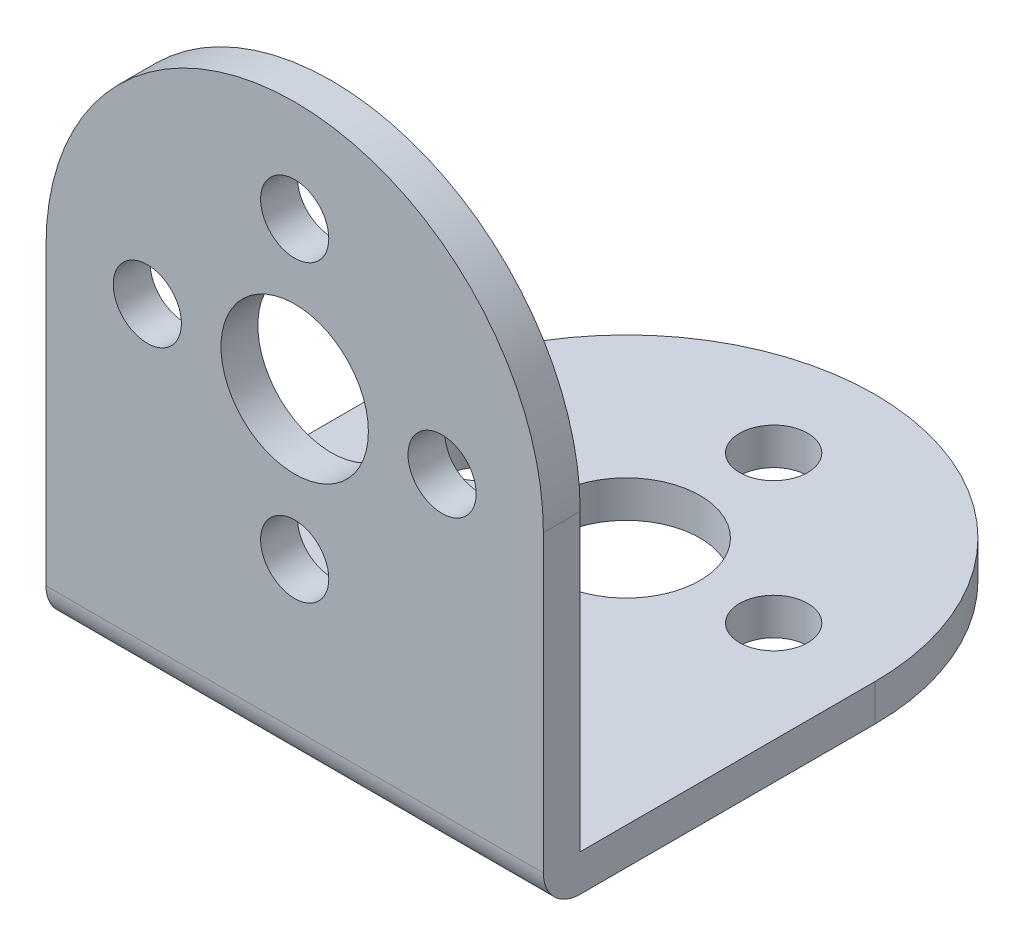
ISO-10303-21;
HEADER;
FILE_DESCRIPTION(('STEP AP214'),'2;1');
FILE_NAME('part.step','',(''),(''),'','','');
FILE_SCHEMA(('AUTOMOTIVE_DESIGN { 1 0 10303 214 1 1 1 1 }'));
ENDSEC;
DATA;
#1=APPLICATION_CONTEXT('core data for automotive mechanical design processes');
#2=APPLICATION_PROTOCOL_DEFINITION('international standard','automotive_design',2000,#1);
#3=PRODUCT_CONTEXT('',#1,'mechanical');
#4=PRODUCT('Part','Part','',(#3));
#5=PRODUCT_RELATED_PRODUCT_CATEGORY('part','',(#4));
#6=PRODUCT_DEFINITION_FORMATION('','',#4);
#7=PRODUCT_DEFINITION_CONTEXT('part definition',#1,'design');
#8=PRODUCT_DEFINITION('design','',#6,#7);
#9=PRODUCT_DEFINITION_SHAPE('','',#8);
#10=(LENGTH_UNIT() NAMED_UNIT(*) SI_UNIT(.MILLI.,.METRE.));
#11=(NAMED_UNIT(*) PLANE_ANGLE_UNIT() SI_UNIT($,.RADIAN.));
#12=(NAMED_UNIT(*) SI_UNIT($,.STERADIAN.) SOLID_ANGLE_UNIT());
#13=UNCERTAINTY_MEASURE_WITH_UNIT(LENGTH_MEASURE(1.E-05),#10,'distance_accuracy_value','');
#14=(GEOMETRIC_REPRESENTATION_CONTEXT(3) GLOBAL_UNCERTAINTY_ASSIGNED_CONTEXT((#13)) GLOBAL_UNIT_ASSIGNED_CONTEXT((#10,
#11,#12)) REPRESENTATION_CONTEXT('',''));
#15=CARTESIAN_POINT('',(0.,0.,0.));
#16=DIRECTION('',(0.,0.,1.));
#17=DIRECTION('',(1.,0.,0.));
#18=AXIS2_PLACEMENT_3D('',#15,#16,#17);
#19=CARTESIAN_POINT('',(0.,0.,-18.));
#20=DIRECTION('',(0.,1.,0.));
#21=DIRECTION('',(0.,0.,1.));
#22=AXIS2_PLACEMENT_3D('',#19,#20,#21);
#23=CYLINDRICAL_SURFACE('',#22,4.);
#24=CARTESIAN_POINT('',(0.,0.,-18.));
#25=DIRECTION('',(0.,1.,0.));
#26=DIRECTION('',(0.,0.,1.));
#27=AXIS2_PLACEMENT_3D('',#24,#25,#26);
#28=CIRCLE('',#27,4.);
#29=CARTESIAN_POINT('',(0.,0.,-14.));
#30=VERTEX_POINT('',#29);
#31=EDGE_CURVE('E18',#30,#30,#28,.T.);
#32=ORIENTED_EDGE('',*,*,#31,.F.);
#33=EDGE_LOOP('',(#32));
#34=FACE_BOUND('',#33,.T.);
#35=CARTESIAN_POINT('',(0.,2.,-18.));
#36=DIRECTION('',(0.,1.,0.));
#37=DIRECTION('',(0.,0.,1.));
#38=AXIS2_PLACEMENT_3D('',#35,#36,#37);
#39=CIRCLE('',#38,4.);
#40=CARTESIAN_POINT('',(0.,2.,-14.));
#41=VERTEX_POINT('',#40);
#42=EDGE_CURVE('E159',#41,#41,#39,.F.);
#43=ORIENTED_EDGE('',*,*,#42,.F.);
#44=EDGE_LOOP('',(#43));
#45=FACE_BOUND('',#44,.T.);
#46=ADVANCED_FACE('F15',(#34,#45),#23,.F.);
#47=CARTESIAN_POINT('',(0.,0.,-26.));
#48=DIRECTION('',(0.,1.,0.));
#49=DIRECTION('',(0.,0.,1.));
#50=AXIS2_PLACEMENT_3D('',#47,#48,#49);
#51=CYLINDRICAL_SURFACE('',#50,1.85);
#52=CARTESIAN_POINT('',(0.,0.,-26.));
#53=DIRECTION('',(0.,1.,0.));
#54=DIRECTION('',(0.,0.,1.));
#55=AXIS2_PLACEMENT_3D('',#52,#53,#54);
#56=CIRCLE('',#55,1.85);
#57=CARTESIAN_POINT('',(0.,0.,-24.15));
#58=VERTEX_POINT('',#57);
#59=EDGE_CURVE('E172',#58,#58,#56,.T.);
#60=ORIENTED_EDGE('',*,*,#59,.F.);
#61=EDGE_LOOP('',(#60));
#62=FACE_BOUND('',#61,.T.);
#63=CARTESIAN_POINT('',(0.,2.,-26.));
#64=DIRECTION('',(0.,1.,0.));
#65=DIRECTION('',(0.,0.,1.));
#66=AXIS2_PLACEMENT_3D('',#63,#64,#65);
#67=CIRCLE('',#66,1.85);
#68=CARTESIAN_POINT('',(0.,2.,-24.15));
#69=VERTEX_POINT('',#68);
#70=EDGE_CURVE('E156',#69,#69,#67,.F.);
#71=ORIENTED_EDGE('',*,*,#70,.F.);
#72=EDGE_LOOP('',(#71));
#73=FACE_BOUND('',#72,.T.);
#74=ADVANCED_FACE('F182',(#62,#73),#51,.F.);
#75=CARTESIAN_POINT('',(8.,0.,-18.));
#76=DIRECTION('',(0.,1.,0.));
#77=DIRECTION('',(0.,0.,1.));
#78=AXIS2_PLACEMENT_3D('',#75,#76,#77);
#79=CYLINDRICAL_SURFACE('',#78,1.85);
#80=CARTESIAN_POINT('',(8.,0.,-18.));
#81=DIRECTION('',(0.,1.,0.));
#82=DIRECTION('',(0.,0.,1.));
#83=AXIS2_PLACEMENT_3D('',#80,#81,#82);
#84=CIRCLE('',#83,1.85);
#85=CARTESIAN_POINT('',(8.,0.,-16.15));
#86=VERTEX_POINT('',#85);
#87=EDGE_CURVE('E170',#86,#86,#84,.T.);
#88=ORIENTED_EDGE('',*,*,#87,.F.);
#89=EDGE_LOOP('',(#88));
#90=FACE_BOUND('',#89,.T.);
#91=CARTESIAN_POINT('',(8.,2.,-18.));
#92=DIRECTION('',(0.,1.,0.));
#93=DIRECTION('',(0.,0.,1.));
#94=AXIS2_PLACEMENT_3D('',#91,#92,#93);
#95=CIRCLE('',#94,1.85);
#96=CARTESIAN_POINT('',(8.,2.,-16.15));
#97=VERTEX_POINT('',#96);
#98=EDGE_CURVE('E153',#97,#97,#95,.F.);
#99=ORIENTED_EDGE('',*,*,#98,.F.);
#100=EDGE_LOOP('',(#99));
#101=FACE_BOUND('',#100,.T.);
#102=ADVANCED_FACE('F364',(#90,#101),#79,.F.);
#103=CARTESIAN_POINT('',(0.,0.,-10.));
#104=DIRECTION('',(0.,1.,0.));
#105=DIRECTION('',(0.,0.,1.));
#106=AXIS2_PLACEMENT_3D('',#103,#104,#105);
#107=CYLINDRICAL_SURFACE('',#106,1.85);
#108=CARTESIAN_POINT('',(0.,0.,-10.));
#109=DIRECTION('',(0.,1.,0.));
#110=DIRECTION('',(0.,0.,1.));
#111=AXIS2_PLACEMENT_3D('',#108,#109,#110);
#112=CIRCLE('',#111,1.85);
#113=CARTESIAN_POINT('',(0.,0.,-8.15));
#114=VERTEX_POINT('',#113);
#115=EDGE_CURVE('E167',#114,#114,#112,.T.);
#116=ORIENTED_EDGE('',*,*,#115,.F.);
#117=EDGE_LOOP('',(#116));
#118=FACE_BOUND('',#117,.T.);
#119=CARTESIAN_POINT('',(0.,2.,-10.));
#120=DIRECTION('',(0.,1.,0.));
#121=DIRECTION('',(0.,0.,1.));
#122=AXIS2_PLACEMENT_3D('',#119,#120,#121);
#123=CIRCLE('',#122,1.85);
#124=CARTESIAN_POINT('',(0.,2.,-8.15));
#125=VERTEX_POINT('',#124);
#126=EDGE_CURVE('E150',#125,#125,#123,.F.);
#127=ORIENTED_EDGE('',*,*,#126,.F.);
#128=EDGE_LOOP('',(#127));
#129=FACE_BOUND('',#128,.T.);
#130=ADVANCED_FACE('F355',(#118,#129),#107,.F.);
#131=CARTESIAN_POINT('',(-8.,0.,-18.));
#132=DIRECTION('',(0.,1.,0.));
#133=DIRECTION('',(0.,0.,1.));
#134=AXIS2_PLACEMENT_3D('',#131,#132,#133);
#135=CYLINDRICAL_SURFACE('',#134,1.85);
#136=CARTESIAN_POINT('',(-8.,0.,-18.));
#137=DIRECTION('',(0.,1.,0.));
#138=DIRECTION('',(0.,0.,1.));
#139=AXIS2_PLACEMENT_3D('',#136,#137,#138);
#140=CIRCLE('',#139,1.85);
#141=CARTESIAN_POINT('',(-8.,0.,-16.15));
#142=VERTEX_POINT('',#141);
#143=EDGE_CURVE('E84',#142,#142,#140,.T.);
#144=ORIENTED_EDGE('',*,*,#143,.F.);
#145=EDGE_LOOP('',(#144));
#146=FACE_BOUND('',#145,.T.);
#147=CARTESIAN_POINT('',(-8.,2.,-18.));
#148=DIRECTION('',(0.,1.,0.));
#149=DIRECTION('',(0.,0.,1.));
#150=AXIS2_PLACEMENT_3D('',#147,#148,#149);
#151=CIRCLE('',#150,1.85);
#152=CARTESIAN_POINT('',(-8.,2.,-16.15));
#153=VERTEX_POINT('',#152);
#154=EDGE_CURVE('E147',#153,#153,#151,.F.);
#155=ORIENTED_EDGE('',*,*,#154,.F.);
#156=EDGE_LOOP('',(#155));
#157=FACE_BOUND('',#156,.T.);
#158=ADVANCED_FACE('F346',(#146,#157),#135,.F.);
#159=CARTESIAN_POINT('',(-13.5,0.,0.));
#160=DIRECTION('',(0.,-1.,0.));
#161=DIRECTION('',(0.,0.,-1.));
#162=AXIS2_PLACEMENT_3D('',#159,#160,#161);
#163=PLANE('',#162);
#164=ORIENTED_EDGE('',*,*,#143,.T.);
#165=EDGE_LOOP('',(#164));
#166=FACE_BOUND('',#165,.T.);
#167=ORIENTED_EDGE('',*,*,#115,.T.);
#168=EDGE_LOOP('',(#167));
#169=FACE_BOUND('',#168,.T.);
#170=ORIENTED_EDGE('',*,*,#87,.T.);
#171=EDGE_LOOP('',(#170));
#172=FACE_BOUND('',#171,.T.);
#173=ORIENTED_EDGE('',*,*,#59,.T.);
#174=EDGE_LOOP('',(#173));
#175=FACE_BOUND('',#174,.T.);
#176=ORIENTED_EDGE('',*,*,#31,.T.);
#177=EDGE_LOOP('',(#176));
#178=FACE_BOUND('',#177,.T.);
#179=CARTESIAN_POINT('',(0.,0.,-18.));
#180=DIRECTION('',(0.,1.,0.));
#181=DIRECTION('',(0.,0.,1.));
#182=AXIS2_PLACEMENT_3D('',#179,#180,#181);
#183=CIRCLE('',#182,13.5);
#184=CARTESIAN_POINT('',(13.5,0.,-18.));
#185=VERTEX_POINT('',#184);
#186=CARTESIAN_POINT('',(-13.5,0.,-18.));
#187=VERTEX_POINT('',#186);
#188=EDGE_CURVE('E73',#185,#187,#183,.T.);
#189=ORIENTED_EDGE('',*,*,#188,.F.);
#190=DIRECTION('',(0.,0.,-1.));
#191=VECTOR('',#190,1.);
#192=CARTESIAN_POINT('',(13.5,0.,0.));
#193=LINE('',#192,#191);
#194=CARTESIAN_POINT('',(13.5,0.,-2.));
#195=VERTEX_POINT('',#194);
#196=EDGE_CURVE('E77',#195,#185,#193,.T.);
#197=ORIENTED_EDGE('',*,*,#196,.F.);
#198=DIRECTION('',(-1.,0.,0.));
#199=VECTOR('',#198,1.);
#200=CARTESIAN_POINT('',(48.6972,0.,-2.));
#201=LINE('',#200,#199);
#202=CARTESIAN_POINT('',(-13.5,0.,-2.));
#203=VERTEX_POINT('',#202);
#204=EDGE_CURVE('E83',#203,#195,#201,.F.);
#205=ORIENTED_EDGE('',*,*,#204,.F.);
#206=DIRECTION('',(0.,0.,-1.));
#207=VECTOR('',#206,1.);
#208=CARTESIAN_POINT('',(-13.5,0.,0.));
#209=LINE('',#208,#207);
#210=EDGE_CURVE('E80',#203,#187,#209,.T.);
#211=ORIENTED_EDGE('',*,*,#210,.T.);
#212=EDGE_LOOP('',(#189,#197,#205,#211));
#213=FACE_BOUND('',#212,.T.);
#214=ADVANCED_FACE('F75',(#166,#169,#172,#175,#178,#213),#163,.T.);
#215=CARTESIAN_POINT('',(0.,-41.0634,-18.));
#216=DIRECTION('',(0.,1.,0.));
#217=DIRECTION('',(0.,0.,1.));
#218=AXIS2_PLACEMENT_3D('',#215,#216,#217);
#219=CYLINDRICAL_SURFACE('',#218,13.5);
#220=ORIENTED_EDGE('',*,*,#188,.T.);
#221=DIRECTION('',(0.,1.,0.));
#222=VECTOR('',#221,1.);
#223=CARTESIAN_POINT('',(-13.5,0.,-18.));
#224=LINE('',#223,#222);
#225=CARTESIAN_POINT('',(-13.5,2.,-18.));
#226=VERTEX_POINT('',#225);
#227=EDGE_CURVE('E110',#187,#226,#224,.T.);
#228=ORIENTED_EDGE('',*,*,#227,.T.);
#229=CARTESIAN_POINT('',(0.,2.,-18.));
#230=DIRECTION('',(0.,1.,0.));
#231=DIRECTION('',(0.,0.,1.));
#232=AXIS2_PLACEMENT_3D('',#229,#230,#231);
#233=CIRCLE('',#232,13.5);
#234=CARTESIAN_POINT('',(13.5,2.,-18.));
#235=VERTEX_POINT('',#234);
#236=EDGE_CURVE('E89',#235,#226,#233,.T.);
#237=ORIENTED_EDGE('',*,*,#236,.F.);
#238=DIRECTION('',(0.,1.,0.));
#239=VECTOR('',#238,1.);
#240=CARTESIAN_POINT('',(13.5,0.,-18.));
#241=LINE('',#240,#239);
#242=EDGE_CURVE('E87',#185,#235,#241,.T.);
#243=ORIENTED_EDGE('',*,*,#242,.F.);
#244=EDGE_LOOP('',(#220,#228,#237,#243));
#245=FACE_BOUND('',#244,.T.);
#246=ADVANCED_FACE('F88',(#245),#219,.T.);
#247=CARTESIAN_POINT('',(48.6972,2.,-2.));
#248=DIRECTION('',(-1.,0.,0.));
#249=DIRECTION('',(0.,0.,1.));
#250=AXIS2_PLACEMENT_3D('',#247,#248,#249);
#251=CYLINDRICAL_SURFACE('',#250,2.);
#252=CARTESIAN_POINT('',(13.5,2.,-2.));
#253=DIRECTION('',(-1.,0.,0.));
#254=DIRECTION('',(0.,0.,1.));
#255=AXIS2_PLACEMENT_3D('',#252,#253,#254);
#256=CIRCLE('',#255,2.);
#257=CARTESIAN_POINT('',(13.5,2.,0.));
#258=VERTEX_POINT('',#257);
#259=EDGE_CURVE('E97',#258,#195,#256,.F.);
#260=ORIENTED_EDGE('',*,*,#259,.F.);
#261=DIRECTION('',(1.,0.,0.));
#262=VECTOR('',#261,1.);
#263=CARTESIAN_POINT('',(-13.5,2.,0.));
#264=LINE('',#263,#262);
#265=CARTESIAN_POINT('',(-13.5,2.,0.));
#266=VERTEX_POINT('',#265);
#267=EDGE_CURVE('E107',#266,#258,#264,.T.);
#268=ORIENTED_EDGE('',*,*,#267,.F.);
#269=CARTESIAN_POINT('',(-13.5,2.,-2.));
#270=DIRECTION('',(-1.,0.,0.));
#271=DIRECTION('',(0.,0.,1.));
#272=AXIS2_PLACEMENT_3D('',#269,#270,#271);
#273=CIRCLE('',#272,2.);
#274=EDGE_CURVE('E143',#266,#203,#273,.F.);
#275=ORIENTED_EDGE('',*,*,#274,.T.);
#276=ORIENTED_EDGE('',*,*,#204,.T.);
#277=EDGE_LOOP('',(#260,#268,#275,#276));
#278=FACE_BOUND('',#277,.T.);
#279=ADVANCED_FACE('F217',(#278),#251,.T.);
#280=CARTESIAN_POINT('',(-13.5,31.5,0.));
#281=DIRECTION('',(0.,0.,1.));
#282=DIRECTION('',(1.,0.,0.));
#283=AXIS2_PLACEMENT_3D('',#280,#281,#282);
#284=PLANE('',#283);
#285=CARTESIAN_POINT('',(-8.,18.,0.));
#286=DIRECTION('',(0.,0.,1.));
#287=DIRECTION('',(1.,0.,0.));
#288=AXIS2_PLACEMENT_3D('',#285,#286,#287);
#289=CIRCLE('',#288,1.85);
#290=CARTESIAN_POINT('',(-6.15,18.,0.));
#291=VERTEX_POINT('',#290);
#292=EDGE_CURVE('E128',#291,#291,#289,.F.);
#293=ORIENTED_EDGE('',*,*,#292,.T.);
#294=EDGE_LOOP('',(#293));
#295=FACE_BOUND('',#294,.T.);
#296=CARTESIAN_POINT('',(0.,10.,0.));
#297=DIRECTION('',(0.,0.,1.));
#298=DIRECTION('',(1.,0.,0.));
#299=AXIS2_PLACEMENT_3D('',#296,#297,#298);
#300=CIRCLE('',#299,1.85);
#301=CARTESIAN_POINT('',(1.85,10.,0.));
#302=VERTEX_POINT('',#301);
#303=EDGE_CURVE('E131',#302,#302,#300,.F.);
#304=ORIENTED_EDGE('',*,*,#303,.T.);
#305=EDGE_LOOP('',(#304));
#306=FACE_BOUND('',#305,.T.);
#307=CARTESIAN_POINT('',(8.,18.,0.));
#308=DIRECTION('',(0.,0.,1.));
#309=DIRECTION('',(1.,0.,0.));
#310=AXIS2_PLACEMENT_3D('',#307,#308,#309);
#311=CIRCLE('',#310,1.85);
#312=CARTESIAN_POINT('',(9.85,18.,0.));
#313=VERTEX_POINT('',#312);
#314=EDGE_CURVE('E134',#313,#313,#311,.F.);
#315=ORIENTED_EDGE('',*,*,#314,.T.);
#316=EDGE_LOOP('',(#315));
#317=FACE_BOUND('',#316,.T.);
#318=CARTESIAN_POINT('',(0.,26.,0.));
#319=DIRECTION('',(0.,0.,1.));
#320=DIRECTION('',(1.,0.,0.));
#321=AXIS2_PLACEMENT_3D('',#318,#319,#320);
#322=CIRCLE('',#321,1.85);
#323=CARTESIAN_POINT('',(1.85,26.,0.));
#324=VERTEX_POINT('',#323);
#325=EDGE_CURVE('E137',#324,#324,#322,.F.);
#326=ORIENTED_EDGE('',*,*,#325,.T.);
#327=EDGE_LOOP('',(#326));
#328=FACE_BOUND('',#327,.T.);
#329=CARTESIAN_POINT('',(0.,18.,0.));
#330=DIRECTION('',(0.,0.,1.));
#331=DIRECTION('',(1.,0.,0.));
#332=AXIS2_PLACEMENT_3D('',#329,#330,#331);
#333=CIRCLE('',#332,4.);
#334=CARTESIAN_POINT('',(4.,18.,0.));
#335=VERTEX_POINT('',#334);
#336=EDGE_CURVE('E140',#335,#335,#333,.F.);
#337=ORIENTED_EDGE('',*,*,#336,.T.);
#338=EDGE_LOOP('',(#337));
#339=FACE_BOUND('',#338,.T.);
#340=CARTESIAN_POINT('',(0.,18.,0.));
#341=DIRECTION('',(0.,0.,1.));
#342=DIRECTION('',(1.,0.,0.));
#343=AXIS2_PLACEMENT_3D('',#340,#341,#342);
#344=CIRCLE('',#343,13.5);
#345=CARTESIAN_POINT('',(-13.5,18.,0.));
#346=VERTEX_POINT('',#345);
#347=CARTESIAN_POINT('',(13.5,18.,0.));
#348=VERTEX_POINT('',#347);
#349=EDGE_CURVE('E99',#346,#348,#344,.F.);
#350=ORIENTED_EDGE('',*,*,#349,.F.);
#351=DIRECTION('',(0.,1.,0.));
#352=VECTOR('',#351,1.);
#353=CARTESIAN_POINT('',(-13.5,0.,0.));
#354=LINE('',#353,#352);
#355=EDGE_CURVE('E146',#346,#266,#354,.F.);
#356=ORIENTED_EDGE('',*,*,#355,.T.);
#357=ORIENTED_EDGE('',*,*,#267,.T.);
#358=DIRECTION('',(0.,1.,0.));
#359=VECTOR('',#358,1.);
#360=CARTESIAN_POINT('',(13.5,0.,0.));
#361=LINE('',#360,#359);
#362=EDGE_CURVE('E103',#348,#258,#361,.F.);
#363=ORIENTED_EDGE('',*,*,#362,.F.);
#364=EDGE_LOOP('',(#350,#356,#357,#363));
#365=FACE_BOUND('',#364,.T.);
#366=ADVANCED_FACE('F215',(#295,#306,#317,#328,#339,#365),#284,.T.);
#367=CARTESIAN_POINT('',(0.,18.,-72.5634));
#368=DIRECTION('',(0.,0.,1.));
#369=DIRECTION('',(1.,0.,0.));
#370=AXIS2_PLACEMENT_3D('',#367,#368,#369);
#371=CYLINDRICAL_SURFACE('',#370,13.5);
#372=CARTESIAN_POINT('',(0.,18.,-2.));
#373=DIRECTION('',(0.,0.,1.));
#374=DIRECTION('',(1.,0.,0.));
#375=AXIS2_PLACEMENT_3D('',#372,#373,#374);
#376=CIRCLE('',#375,13.5);
#377=CARTESIAN_POINT('',(-13.5,18.,-2.));
#378=VERTEX_POINT('',#377);
#379=CARTESIAN_POINT('',(13.5,18.,-2.));
#380=VERTEX_POINT('',#379);
#381=EDGE_CURVE('E124',#378,#380,#376,.F.);
#382=ORIENTED_EDGE('',*,*,#381,.F.);
#383=DIRECTION('',(0.,0.,-1.));
#384=VECTOR('',#383,1.);
#385=CARTESIAN_POINT('',(-13.5,18.,0.));
#386=LINE('',#385,#384);
#387=EDGE_CURVE('E203',#378,#346,#386,.F.);
#388=ORIENTED_EDGE('',*,*,#387,.T.);
#389=ORIENTED_EDGE('',*,*,#349,.T.);
#390=DIRECTION('',(0.,0.,-1.));
#391=VECTOR('',#390,1.);
#392=CARTESIAN_POINT('',(13.5,18.,0.));
#393=LINE('',#392,#391);
#394=EDGE_CURVE('E92',#380,#348,#393,.F.);
#395=ORIENTED_EDGE('',*,*,#394,.F.);
#396=EDGE_LOOP('',(#382,#388,#389,#395));
#397=FACE_BOUND('',#396,.T.);
#398=ADVANCED_FACE('F210',(#397),#371,.T.);
#399=CARTESIAN_POINT('',(13.5,0.,0.));
#400=DIRECTION('',(1.,0.,0.));
#401=DIRECTION('',(0.,0.,-1.));
#402=AXIS2_PLACEMENT_3D('',#399,#400,#401);
#403=PLANE('',#402);
#404=ORIENTED_EDGE('',*,*,#394,.T.);
#405=ORIENTED_EDGE('',*,*,#362,.T.);
#406=ORIENTED_EDGE('',*,*,#259,.T.);
#407=ORIENTED_EDGE('',*,*,#196,.T.);
#408=ORIENTED_EDGE('',*,*,#242,.T.);
#409=DIRECTION('',(0.,0.,1.));
#410=VECTOR('',#409,1.);
#411=CARTESIAN_POINT('',(13.5,2.,-31.5));
#412=LINE('',#411,#410);
#413=CARTESIAN_POINT('',(13.5,2.,-2.));
#414=VERTEX_POINT('',#413);
#415=EDGE_CURVE('E162',#414,#235,#412,.F.);
#416=ORIENTED_EDGE('',*,*,#415,.F.);
#417=DIRECTION('',(0.,1.,0.));
#418=VECTOR('',#417,1.);
#419=CARTESIAN_POINT('',(13.5,2.,-2.));
#420=LINE('',#419,#418);
#421=EDGE_CURVE('E127',#380,#414,#420,.F.);
#422=ORIENTED_EDGE('',*,*,#421,.F.);
#423=EDGE_LOOP('',(#404,#405,#406,#407,#408,#416,#422));
#424=FACE_BOUND('',#423,.T.);
#425=ADVANCED_FACE('F95',(#424),#403,.T.);
#426=CARTESIAN_POINT('',(-13.5,2.,-31.5));
#427=DIRECTION('',(0.,1.,0.));
#428=DIRECTION('',(0.,0.,1.));
#429=AXIS2_PLACEMENT_3D('',#426,#427,#428);
#430=PLANE('',#429);
#431=ORIENTED_EDGE('',*,*,#154,.T.);
#432=EDGE_LOOP('',(#431));
#433=FACE_BOUND('',#432,.T.);
#434=ORIENTED_EDGE('',*,*,#126,.T.);
#435=EDGE_LOOP('',(#434));
#436=FACE_BOUND('',#435,.T.);
#437=ORIENTED_EDGE('',*,*,#98,.T.);
#438=EDGE_LOOP('',(#437));
#439=FACE_BOUND('',#438,.T.);
#440=ORIENTED_EDGE('',*,*,#70,.T.);
#441=EDGE_LOOP('',(#440));
#442=FACE_BOUND('',#441,.T.);
#443=ORIENTED_EDGE('',*,*,#42,.T.);
#444=EDGE_LOOP('',(#443));
#445=FACE_BOUND('',#444,.T.);
#446=DIRECTION('',(-1.,0.,0.));
#447=VECTOR('',#446,1.);
#448=CARTESIAN_POINT('',(-13.5,2.,-2.));
#449=LINE('',#448,#447);
#450=CARTESIAN_POINT('',(-13.5,2.,-2.));
#451=VERTEX_POINT('',#450);
#452=EDGE_CURVE('E191',#414,#451,#449,.T.);
#453=ORIENTED_EDGE('',*,*,#452,.F.);
#454=ORIENTED_EDGE('',*,*,#415,.T.);
#455=ORIENTED_EDGE('',*,*,#236,.T.);
#456=DIRECTION('',(0.,0.,-1.));
#457=VECTOR('',#456,1.);
#458=CARTESIAN_POINT('',(-13.5,2.,0.));
#459=LINE('',#458,#457);
#460=EDGE_CURVE('E33',#226,#451,#459,.F.);
#461=ORIENTED_EDGE('',*,*,#460,.T.);
#462=EDGE_LOOP('',(#453,#454,#455,#461));
#463=FACE_BOUND('',#462,.T.);
#464=ADVANCED_FACE('F185',(#433,#436,#439,#442,#445,#463),#430,.T.);
#465=CARTESIAN_POINT('',(-13.5,0.,0.));
#466=DIRECTION('',(1.,0.,0.));
#467=DIRECTION('',(0.,0.,-1.));
#468=AXIS2_PLACEMENT_3D('',#465,#466,#467);
#469=PLANE('',#468);
#470=ORIENTED_EDGE('',*,*,#355,.F.);
#471=ORIENTED_EDGE('',*,*,#387,.F.);
#472=DIRECTION('',(0.,1.,0.));
#473=VECTOR('',#472,1.);
#474=CARTESIAN_POINT('',(-13.5,2.,-2.));
#475=LINE('',#474,#473);
#476=EDGE_CURVE('E123',#451,#378,#475,.T.);
#477=ORIENTED_EDGE('',*,*,#476,.F.);
#478=ORIENTED_EDGE('',*,*,#460,.F.);
#479=ORIENTED_EDGE('',*,*,#227,.F.);
#480=ORIENTED_EDGE('',*,*,#210,.F.);
#481=ORIENTED_EDGE('',*,*,#274,.F.);
#482=EDGE_LOOP('',(#470,#471,#477,#478,#479,#480,#481));
#483=FACE_BOUND('',#482,.T.);
#484=ADVANCED_FACE('F187',(#483),#469,.F.);
#485=CARTESIAN_POINT('',(0.,18.,0.));
#486=DIRECTION('',(0.,0.,1.));
#487=DIRECTION('',(1.,0.,0.));
#488=AXIS2_PLACEMENT_3D('',#485,#486,#487);
#489=CYLINDRICAL_SURFACE('',#488,4.);
#490=CARTESIAN_POINT('',(0.,18.,-2.));
#491=DIRECTION('',(0.,0.,1.));
#492=DIRECTION('',(1.,0.,0.));
#493=AXIS2_PLACEMENT_3D('',#490,#491,#492);
#494=CIRCLE('',#493,4.);
#495=CARTESIAN_POINT('',(4.,18.,-2.));
#496=VERTEX_POINT('',#495);
#497=EDGE_CURVE('E120',#496,#496,#494,.T.);
#498=ORIENTED_EDGE('',*,*,#497,.F.);
#499=EDGE_LOOP('',(#498));
#500=FACE_BOUND('',#499,.T.);
#501=ORIENTED_EDGE('',*,*,#336,.F.);
#502=EDGE_LOOP('',(#501));
#503=FACE_BOUND('',#502,.T.);
#504=ADVANCED_FACE('F250',(#500,#503),#489,.F.);
#505=CARTESIAN_POINT('',(0.,26.,0.));
#506=DIRECTION('',(0.,0.,1.));
#507=DIRECTION('',(1.,0.,0.));
#508=AXIS2_PLACEMENT_3D('',#505,#506,#507);
#509=CYLINDRICAL_SURFACE('',#508,1.85);
#510=CARTESIAN_POINT('',(0.,26.,-2.));
#511=DIRECTION('',(0.,0.,1.));
#512=DIRECTION('',(1.,0.,0.));
#513=AXIS2_PLACEMENT_3D('',#510,#511,#512);
#514=CIRCLE('',#513,1.85);
#515=CARTESIAN_POINT('',(1.85,26.,-2.));
#516=VERTEX_POINT('',#515);
#517=EDGE_CURVE('E117',#516,#516,#514,.T.);
#518=ORIENTED_EDGE('',*,*,#517,.F.);
#519=EDGE_LOOP('',(#518));
#520=FACE_BOUND('',#519,.T.);
#521=ORIENTED_EDGE('',*,*,#325,.F.);
#522=EDGE_LOOP('',(#521));
#523=FACE_BOUND('',#522,.T.);
#524=ADVANCED_FACE('F246',(#520,#523),#509,.F.);
#525=CARTESIAN_POINT('',(8.,18.,0.));
#526=DIRECTION('',(0.,0.,1.));
#527=DIRECTION('',(1.,0.,0.));
#528=AXIS2_PLACEMENT_3D('',#525,#526,#527);
#529=CYLINDRICAL_SURFACE('',#528,1.85);
#530=CARTESIAN_POINT('',(8.,18.,-2.));
#531=DIRECTION('',(0.,0.,1.));
#532=DIRECTION('',(1.,0.,0.));
#533=AXIS2_PLACEMENT_3D('',#530,#531,#532);
#534=CIRCLE('',#533,1.85);
#535=CARTESIAN_POINT('',(9.85,18.,-2.));
#536=VERTEX_POINT('',#535);
#537=EDGE_CURVE('E114',#536,#536,#534,.T.);
#538=ORIENTED_EDGE('',*,*,#537,.F.);
#539=EDGE_LOOP('',(#538));
#540=FACE_BOUND('',#539,.T.);
#541=ORIENTED_EDGE('',*,*,#314,.F.);
#542=EDGE_LOOP('',(#541));
#543=FACE_BOUND('',#542,.T.);
#544=ADVANCED_FACE('F242',(#540,#543),#529,.F.);
#545=CARTESIAN_POINT('',(0.,10.,0.));
#546=DIRECTION('',(0.,0.,1.));
#547=DIRECTION('',(1.,0.,0.));
#548=AXIS2_PLACEMENT_3D('',#545,#546,#547);
#549=CYLINDRICAL_SURFACE('',#548,1.85);
#550=CARTESIAN_POINT('',(0.,10.,-2.));
#551=DIRECTION('',(0.,0.,1.));
#552=DIRECTION('',(1.,0.,0.));
#553=AXIS2_PLACEMENT_3D('',#550,#551,#552);
#554=CIRCLE('',#553,1.85);
#555=CARTESIAN_POINT('',(1.85,10.,-2.));
#556=VERTEX_POINT('',#555);
#557=EDGE_CURVE('E24',#556,#556,#554,.T.);
#558=ORIENTED_EDGE('',*,*,#557,.F.);
#559=EDGE_LOOP('',(#558));
#560=FACE_BOUND('',#559,.T.);
#561=ORIENTED_EDGE('',*,*,#303,.F.);
#562=EDGE_LOOP('',(#561));
#563=FACE_BOUND('',#562,.T.);
#564=ADVANCED_FACE('F235',(#560,#563),#549,.F.);
#565=CARTESIAN_POINT('',(-8.,18.,0.));
#566=DIRECTION('',(0.,0.,1.));
#567=DIRECTION('',(1.,0.,0.));
#568=AXIS2_PLACEMENT_3D('',#565,#566,#567);
#569=CYLINDRICAL_SURFACE('',#568,1.85);
#570=CARTESIAN_POINT('',(-8.,18.,-2.));
#571=DIRECTION('',(0.,0.,1.));
#572=DIRECTION('',(1.,0.,0.));
#573=AXIS2_PLACEMENT_3D('',#570,#571,#572);
#574=CIRCLE('',#573,1.85);
#575=CARTESIAN_POINT('',(-6.15,18.,-2.));
#576=VERTEX_POINT('',#575);
#577=EDGE_CURVE('E10',#576,#576,#574,.T.);
#578=ORIENTED_EDGE('',*,*,#577,.F.);
#579=EDGE_LOOP('',(#578));
#580=FACE_BOUND('',#579,.T.);
#581=ORIENTED_EDGE('',*,*,#292,.F.);
#582=EDGE_LOOP('',(#581));
#583=FACE_BOUND('',#582,.T.);
#584=ADVANCED_FACE('F229',(#580,#583),#569,.F.);
#585=CARTESIAN_POINT('',(-13.5,2.,-2.));
#586=DIRECTION('',(0.,0.,-1.));
#587=DIRECTION('',(-1.,0.,0.));
#588=AXIS2_PLACEMENT_3D('',#585,#586,#587);
#589=PLANE('',#588);
#590=ORIENTED_EDGE('',*,*,#577,.T.);
#591=EDGE_LOOP('',(#590));
#592=FACE_BOUND('',#591,.T.);
#593=ORIENTED_EDGE('',*,*,#557,.T.);
#594=EDGE_LOOP('',(#593));
#595=FACE_BOUND('',#594,.T.);
#596=ORIENTED_EDGE('',*,*,#537,.T.);
#597=EDGE_LOOP('',(#596));
#598=FACE_BOUND('',#597,.T.);
#599=ORIENTED_EDGE('',*,*,#517,.T.);
#600=EDGE_LOOP('',(#599));
#601=FACE_BOUND('',#600,.T.);
#602=ORIENTED_EDGE('',*,*,#497,.T.);
#603=EDGE_LOOP('',(#602));
#604=FACE_BOUND('',#603,.T.);
#605=ORIENTED_EDGE('',*,*,#452,.T.);
#606=ORIENTED_EDGE('',*,*,#476,.T.);
#607=ORIENTED_EDGE('',*,*,#381,.T.);
#608=ORIENTED_EDGE('',*,*,#421,.T.);
#609=EDGE_LOOP('',(#605,#606,#607,#608));
#610=FACE_BOUND('',#609,.T.);
#611=ADVANCED_FACE('F197',(#592,#595,#598,#601,#604,#610),#589,.T.);
#612=CLOSED_SHELL('',(#46,#74,#102,#130,#158,#214,#246,#279,#366,#398,#425,#464,#484,#504,#524,
#544,#564,#584,#611));
#613=MANIFOLD_SOLID_BREP('B1',#612);
#614=ADVANCED_BREP_SHAPE_REPRESENTATION('',(#18,#613),#14);
#615=SHAPE_DEFINITION_REPRESENTATION(#9,#614);
ENDSEC;
END-ISO-10303-21;
